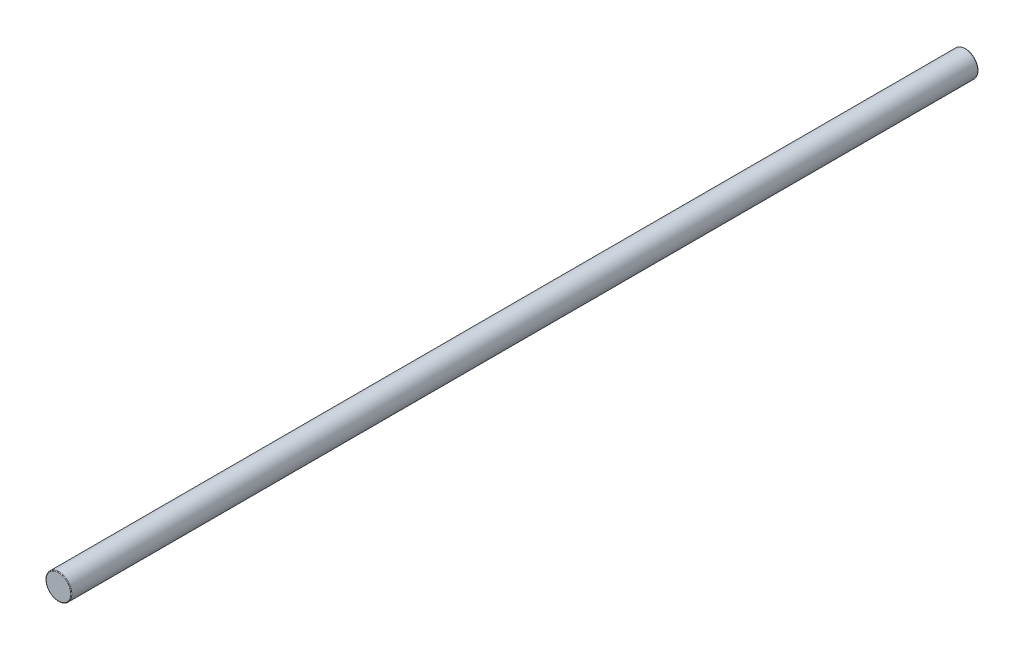
ISO-10303-21;
HEADER;
FILE_DESCRIPTION(('STEP AP214'),'2;1');
FILE_NAME('part.step','',(''),(''),'','','');
FILE_SCHEMA(('AUTOMOTIVE_DESIGN { 1 0 10303 214 1 1 1 1 }'));
ENDSEC;
DATA;
#1=APPLICATION_CONTEXT('core data for automotive mechanical design processes');
#2=APPLICATION_PROTOCOL_DEFINITION('international standard','automotive_design',2000,#1);
#3=PRODUCT_CONTEXT('',#1,'mechanical');
#4=PRODUCT('Part','Part','',(#3));
#5=PRODUCT_RELATED_PRODUCT_CATEGORY('part','',(#4));
#6=PRODUCT_DEFINITION_FORMATION('','',#4);
#7=PRODUCT_DEFINITION_CONTEXT('part definition',#1,'design');
#8=PRODUCT_DEFINITION('design','',#6,#7);
#9=PRODUCT_DEFINITION_SHAPE('','',#8);
#10=(LENGTH_UNIT() NAMED_UNIT(*) SI_UNIT(.MILLI.,.METRE.));
#11=(NAMED_UNIT(*) PLANE_ANGLE_UNIT() SI_UNIT($,.RADIAN.));
#12=(NAMED_UNIT(*) SI_UNIT($,.STERADIAN.) SOLID_ANGLE_UNIT());
#13=UNCERTAINTY_MEASURE_WITH_UNIT(LENGTH_MEASURE(1.E-05),#10,'distance_accuracy_value','');
#14=(GEOMETRIC_REPRESENTATION_CONTEXT(3) GLOBAL_UNCERTAINTY_ASSIGNED_CONTEXT((#13)) GLOBAL_UNIT_ASSIGNED_CONTEXT((#10,
#11,#12)) REPRESENTATION_CONTEXT('',''));
#15=CARTESIAN_POINT('',(0.,0.,0.));
#16=DIRECTION('',(0.,0.,1.));
#17=DIRECTION('',(1.,0.,0.));
#18=AXIS2_PLACEMENT_3D('',#15,#16,#17);
#19=CARTESIAN_POINT('',(0.,0.,-283.));
#20=DIRECTION('',(0.,0.,1.));
#21=DIRECTION('',(1.,0.,0.));
#22=AXIS2_PLACEMENT_3D('',#19,#20,#21);
#23=CYLINDRICAL_SURFACE('',#22,4.);
#24=CARTESIAN_POINT('',(0.,0.,-282.8));
#25=DIRECTION('',(0.,0.,1.));
#26=DIRECTION('',(1.,0.,0.));
#27=AXIS2_PLACEMENT_3D('',#24,#25,#26);
#28=CIRCLE('',#27,4.);
#29=CARTESIAN_POINT('',(4.,0.,-282.8));
#30=VERTEX_POINT('',#29);
#31=EDGE_CURVE('E42',#30,#30,#28,.T.);
#32=ORIENTED_EDGE('',*,*,#31,.T.);
#33=EDGE_LOOP('',(#32));
#34=FACE_BOUND('',#33,.T.);
#35=CARTESIAN_POINT('',(0.,0.,-0.199999999999978));
#36=DIRECTION('',(0.,0.,1.));
#37=DIRECTION('',(1.,0.,0.));
#38=AXIS2_PLACEMENT_3D('',#35,#36,#37);
#39=CIRCLE('',#38,4.);
#40=CARTESIAN_POINT('',(4.,0.,-0.199999999999978));
#41=VERTEX_POINT('',#40);
#42=EDGE_CURVE('E46',#41,#41,#39,.F.);
#43=ORIENTED_EDGE('',*,*,#42,.T.);
#44=EDGE_LOOP('',(#43));
#45=FACE_BOUND('',#44,.T.);
#46=ADVANCED_FACE('F31',(#34,#45),#23,.T.);
#47=CARTESIAN_POINT('',(0.,0.,-283.));
#48=DIRECTION('',(0.,0.,1.));
#49=DIRECTION('',(1.,0.,0.));
#50=AXIS2_PLACEMENT_3D('',#47,#48,#49);
#51=PLANE('',#50);
#52=CARTESIAN_POINT('',(0.,0.,-283.));
#53=DIRECTION('',(0.,0.,1.));
#54=DIRECTION('',(1.,0.,0.));
#55=AXIS2_PLACEMENT_3D('',#52,#53,#54);
#56=CIRCLE('',#55,3.8);
#57=CARTESIAN_POINT('',(3.8,0.,-283.));
#58=VERTEX_POINT('',#57);
#59=EDGE_CURVE('E38',#58,#58,#56,.F.);
#60=ORIENTED_EDGE('',*,*,#59,.T.);
#61=EDGE_LOOP('',(#60));
#62=FACE_BOUND('',#61,.T.);
#63=ADVANCED_FACE('F62',(#62),#51,.F.);
#64=CARTESIAN_POINT('',(0.,0.,0.));
#65=DIRECTION('',(0.,0.,1.));
#66=DIRECTION('',(1.,0.,0.));
#67=AXIS2_PLACEMENT_3D('',#64,#65,#66);
#68=PLANE('',#67);
#69=CARTESIAN_POINT('',(0.,0.,0.));
#70=DIRECTION('',(0.,0.,1.));
#71=DIRECTION('',(1.,0.,0.));
#72=AXIS2_PLACEMENT_3D('',#69,#70,#71);
#73=CIRCLE('',#72,3.8);
#74=CARTESIAN_POINT('',(3.8,0.,0.));
#75=VERTEX_POINT('',#74);
#76=EDGE_CURVE('E10',#75,#75,#73,.T.);
#77=ORIENTED_EDGE('',*,*,#76,.T.);
#78=EDGE_LOOP('',(#77));
#79=FACE_BOUND('',#78,.T.);
#80=ADVANCED_FACE('F59',(#79),#68,.T.);
#81=CARTESIAN_POINT('',(0.,0.,-282.8));
#82=DIRECTION('',(0.,0.,1.));
#83=DIRECTION('',(1.,0.,0.));
#84=AXIS2_PLACEMENT_3D('',#81,#82,#83);
#85=TOROIDAL_SURFACE('',#84,3.8,0.2);
#86=ORIENTED_EDGE('',*,*,#59,.F.);
#87=EDGE_LOOP('',(#86));
#88=FACE_BOUND('',#87,.T.);
#89=ORIENTED_EDGE('',*,*,#31,.F.);
#90=EDGE_LOOP('',(#89));
#91=FACE_BOUND('',#90,.T.);
#92=ADVANCED_FACE('F55',(#88,#91),#85,.T.);
#93=CARTESIAN_POINT('',(0.,0.,-0.199999999999978));
#94=DIRECTION('',(0.,0.,1.));
#95=DIRECTION('',(1.,0.,0.));
#96=AXIS2_PLACEMENT_3D('',#93,#94,#95);
#97=TOROIDAL_SURFACE('',#96,3.8,0.2);
#98=ORIENTED_EDGE('',*,*,#42,.F.);
#99=EDGE_LOOP('',(#98));
#100=FACE_BOUND('',#99,.T.);
#101=ORIENTED_EDGE('',*,*,#76,.F.);
#102=EDGE_LOOP('',(#101));
#103=FACE_BOUND('',#102,.T.);
#104=ADVANCED_FACE('F33',(#100,#103),#97,.T.);
#105=CLOSED_SHELL('',(#46,#63,#80,#92,#104));
#106=MANIFOLD_SOLID_BREP('B2',#105);
#107=ADVANCED_BREP_SHAPE_REPRESENTATION('',(#18,#106),#14);
#108=SHAPE_DEFINITION_REPRESENTATION(#9,#107);
ENDSEC;
END-ISO-10303-21;
